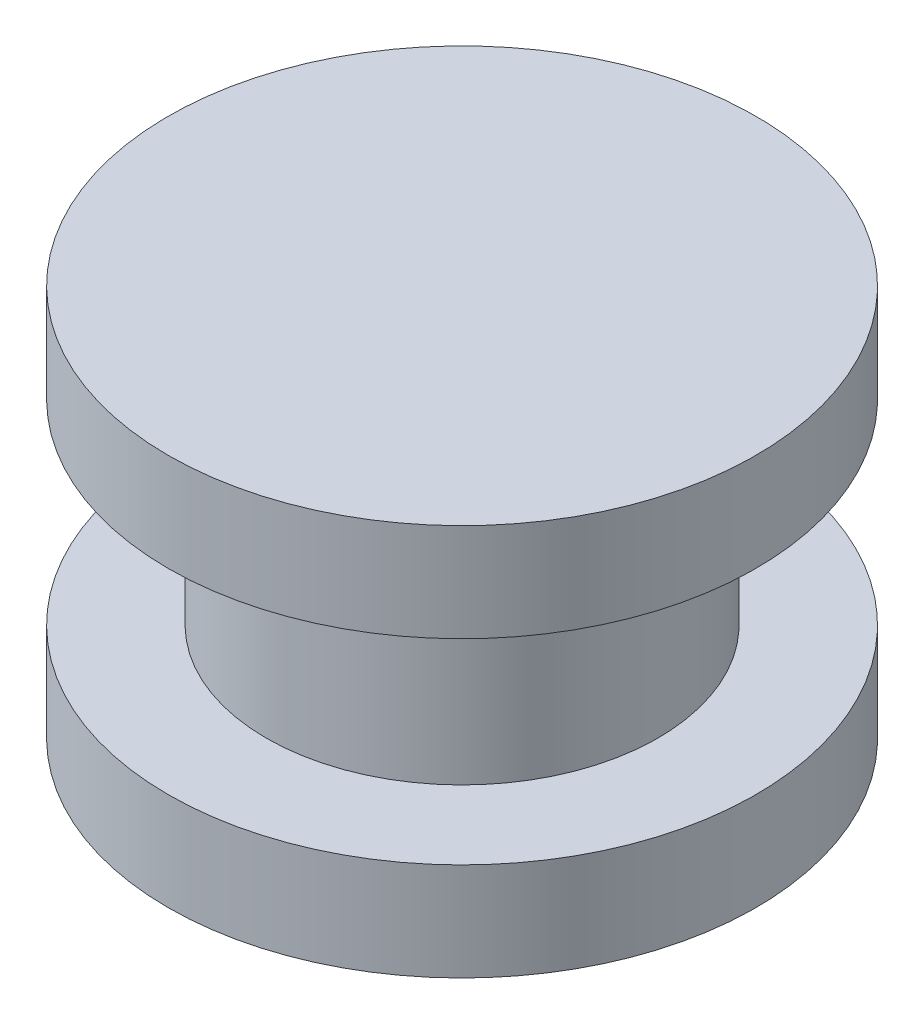
ISO-10303-21;
HEADER;
FILE_DESCRIPTION(('STEP AP214'),'2;1');
FILE_NAME('part.step','',(''),(''),'','','');
FILE_SCHEMA(('AUTOMOTIVE_DESIGN { 1 0 10303 214 1 1 1 1 }'));
ENDSEC;
DATA;
#1=APPLICATION_CONTEXT('core data for automotive mechanical design processes');
#2=APPLICATION_PROTOCOL_DEFINITION('international standard','automotive_design',2000,#1);
#3=PRODUCT_CONTEXT('',#1,'mechanical');
#4=PRODUCT('Part','Part','',(#3));
#5=PRODUCT_RELATED_PRODUCT_CATEGORY('part','',(#4));
#6=PRODUCT_DEFINITION_FORMATION('','',#4);
#7=PRODUCT_DEFINITION_CONTEXT('part definition',#1,'design');
#8=PRODUCT_DEFINITION('design','',#6,#7);
#9=PRODUCT_DEFINITION_SHAPE('','',#8);
#10=(LENGTH_UNIT() NAMED_UNIT(*) SI_UNIT(.MILLI.,.METRE.));
#11=(NAMED_UNIT(*) PLANE_ANGLE_UNIT() SI_UNIT($,.RADIAN.));
#12=(NAMED_UNIT(*) SI_UNIT($,.STERADIAN.) SOLID_ANGLE_UNIT());
#13=UNCERTAINTY_MEASURE_WITH_UNIT(LENGTH_MEASURE(1.E-05),#10,'distance_accuracy_value','');
#14=(GEOMETRIC_REPRESENTATION_CONTEXT(3) GLOBAL_UNCERTAINTY_ASSIGNED_CONTEXT((#13)) GLOBAL_UNIT_ASSIGNED_CONTEXT((#10,
#11,#12)) REPRESENTATION_CONTEXT('',''));
#15=CARTESIAN_POINT('',(0.,0.,0.));
#16=DIRECTION('',(0.,0.,1.));
#17=DIRECTION('',(1.,0.,0.));
#18=AXIS2_PLACEMENT_3D('',#15,#16,#17);
#19=CARTESIAN_POINT('',(0.,1.,0.));
#20=DIRECTION('',(0.,-1.,0.));
#21=DIRECTION('',(0.,0.,-1.));
#22=AXIS2_PLACEMENT_3D('',#19,#20,#21);
#23=CYLINDRICAL_SURFACE('',#22,3.);
#24=CARTESIAN_POINT('',(0.,1.,0.));
#25=DIRECTION('',(0.,1.,0.));
#26=DIRECTION('',(0.,0.,1.));
#27=AXIS2_PLACEMENT_3D('',#24,#25,#26);
#28=CIRCLE('',#27,3.);
#29=CARTESIAN_POINT('',(0.,1.,3.));
#30=VERTEX_POINT('',#29);
#31=EDGE_CURVE('E10',#30,#30,#28,.T.);
#32=ORIENTED_EDGE('',*,*,#31,.F.);
#33=EDGE_LOOP('',(#32));
#34=FACE_BOUND('',#33,.T.);
#35=CARTESIAN_POINT('',(0.,0.,0.));
#36=DIRECTION('',(0.,1.,0.));
#37=DIRECTION('',(0.,0.,1.));
#38=AXIS2_PLACEMENT_3D('',#35,#36,#37);
#39=CIRCLE('',#38,3.);
#40=CARTESIAN_POINT('',(0.,0.,3.));
#41=VERTEX_POINT('',#40);
#42=EDGE_CURVE('E33',#41,#41,#39,.T.);
#43=ORIENTED_EDGE('',*,*,#42,.T.);
#44=EDGE_LOOP('',(#43));
#45=FACE_BOUND('',#44,.T.);
#46=ADVANCED_FACE('F30',(#34,#45),#23,.T.);
#47=CARTESIAN_POINT('',(0.,1.,0.));
#48=DIRECTION('',(0.,1.,0.));
#49=DIRECTION('',(0.,0.,1.));
#50=AXIS2_PLACEMENT_3D('',#47,#48,#49);
#51=PLANE('',#50);
#52=CARTESIAN_POINT('',(0.,1.,0.));
#53=DIRECTION('',(0.,1.,0.));
#54=DIRECTION('',(0.,0.,1.));
#55=AXIS2_PLACEMENT_3D('',#52,#53,#54);
#56=CIRCLE('',#55,2.);
#57=CARTESIAN_POINT('',(0.,1.,2.));
#58=VERTEX_POINT('',#57);
#59=EDGE_CURVE('E42',#58,#58,#56,.T.);
#60=ORIENTED_EDGE('',*,*,#59,.F.);
#61=EDGE_LOOP('',(#60));
#62=FACE_BOUND('',#61,.T.);
#63=ORIENTED_EDGE('',*,*,#31,.T.);
#64=EDGE_LOOP('',(#63));
#65=FACE_BOUND('',#64,.T.);
#66=ADVANCED_FACE('F72',(#62,#65),#51,.T.);
#67=CARTESIAN_POINT('',(0.,0.,0.));
#68=DIRECTION('',(0.,1.,0.));
#69=DIRECTION('',(0.,0.,1.));
#70=AXIS2_PLACEMENT_3D('',#67,#68,#69);
#71=PLANE('',#70);
#72=ORIENTED_EDGE('',*,*,#42,.F.);
#73=EDGE_LOOP('',(#72));
#74=FACE_BOUND('',#73,.T.);
#75=ADVANCED_FACE('F77',(#74),#71,.F.);
#76=CARTESIAN_POINT('',(0.,3.,0.));
#77=DIRECTION('',(0.,-1.,0.));
#78=DIRECTION('',(0.,0.,-1.));
#79=AXIS2_PLACEMENT_3D('',#76,#77,#78);
#80=CYLINDRICAL_SURFACE('',#79,2.);
#81=CARTESIAN_POINT('',(0.,3.,0.));
#82=DIRECTION('',(0.,1.,0.));
#83=DIRECTION('',(0.,0.,1.));
#84=AXIS2_PLACEMENT_3D('',#81,#82,#83);
#85=CIRCLE('',#84,2.);
#86=CARTESIAN_POINT('',(0.,3.,2.));
#87=VERTEX_POINT('',#86);
#88=EDGE_CURVE('E40',#87,#87,#85,.T.);
#89=ORIENTED_EDGE('',*,*,#88,.F.);
#90=EDGE_LOOP('',(#89));
#91=FACE_BOUND('',#90,.T.);
#92=ORIENTED_EDGE('',*,*,#59,.T.);
#93=EDGE_LOOP('',(#92));
#94=FACE_BOUND('',#93,.T.);
#95=ADVANCED_FACE('F59',(#91,#94),#80,.T.);
#96=CARTESIAN_POINT('',(0.,4.,0.));
#97=DIRECTION('',(0.,-1.,0.));
#98=DIRECTION('',(0.,0.,-1.));
#99=AXIS2_PLACEMENT_3D('',#96,#97,#98);
#100=CYLINDRICAL_SURFACE('',#99,3.);
#101=CARTESIAN_POINT('',(0.,4.,0.));
#102=DIRECTION('',(0.,1.,0.));
#103=DIRECTION('',(0.,0.,1.));
#104=AXIS2_PLACEMENT_3D('',#101,#102,#103);
#105=CIRCLE('',#104,3.);
#106=CARTESIAN_POINT('',(0.,4.,3.));
#107=VERTEX_POINT('',#106);
#108=EDGE_CURVE('E45',#107,#107,#105,.T.);
#109=ORIENTED_EDGE('',*,*,#108,.F.);
#110=EDGE_LOOP('',(#109));
#111=FACE_BOUND('',#110,.T.);
#112=CARTESIAN_POINT('',(0.,3.,0.));
#113=DIRECTION('',(0.,1.,0.));
#114=DIRECTION('',(0.,0.,1.));
#115=AXIS2_PLACEMENT_3D('',#112,#113,#114);
#116=CIRCLE('',#115,3.);
#117=CARTESIAN_POINT('',(0.,3.,3.));
#118=VERTEX_POINT('',#117);
#119=EDGE_CURVE('E48',#118,#118,#116,.T.);
#120=ORIENTED_EDGE('',*,*,#119,.T.);
#121=EDGE_LOOP('',(#120));
#122=FACE_BOUND('',#121,.T.);
#123=ADVANCED_FACE('F56',(#111,#122),#100,.T.);
#124=CARTESIAN_POINT('',(0.,4.,0.));
#125=DIRECTION('',(0.,1.,0.));
#126=DIRECTION('',(0.,0.,1.));
#127=AXIS2_PLACEMENT_3D('',#124,#125,#126);
#128=PLANE('',#127);
#129=ORIENTED_EDGE('',*,*,#108,.T.);
#130=EDGE_LOOP('',(#129));
#131=FACE_BOUND('',#130,.T.);
#132=ADVANCED_FACE('F54',(#131),#128,.T.);
#133=CARTESIAN_POINT('',(0.,3.,0.));
#134=DIRECTION('',(0.,1.,0.));
#135=DIRECTION('',(0.,0.,1.));
#136=AXIS2_PLACEMENT_3D('',#133,#134,#135);
#137=PLANE('',#136);
#138=ORIENTED_EDGE('',*,*,#88,.T.);
#139=EDGE_LOOP('',(#138));
#140=FACE_BOUND('',#139,.T.);
#141=ORIENTED_EDGE('',*,*,#119,.F.);
#142=EDGE_LOOP('',(#141));
#143=FACE_BOUND('',#142,.T.);
#144=ADVANCED_FACE('F63',(#140,#143),#137,.F.);
#145=CLOSED_SHELL('',(#46,#66,#75,#95,#123,#132,#144));
#146=MANIFOLD_SOLID_BREP('B2',#145);
#147=ADVANCED_BREP_SHAPE_REPRESENTATION('',(#18,#146),#14);
#148=SHAPE_DEFINITION_REPRESENTATION(#9,#147);
ENDSEC;
END-ISO-10303-21;
